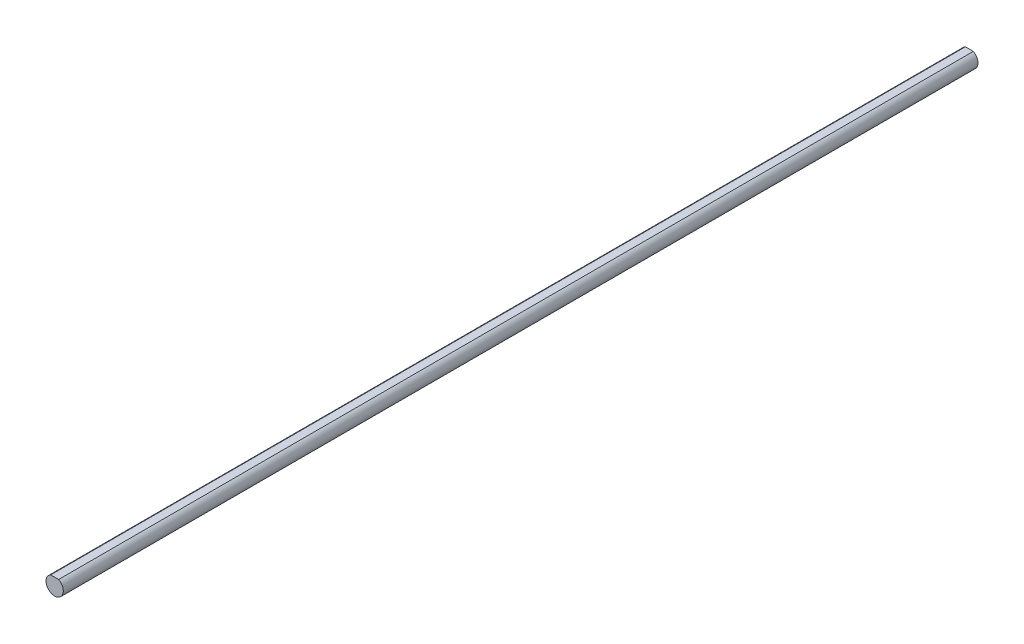
ISO-10303-21;
HEADER;
FILE_DESCRIPTION(('STEP AP214'),'2;1');
FILE_NAME('part.step','',(''),(''),'','','');
FILE_SCHEMA(('AUTOMOTIVE_DESIGN { 1 0 10303 214 1 1 1 1 }'));
ENDSEC;
DATA;
#1=APPLICATION_CONTEXT('core data for automotive mechanical design processes');
#2=APPLICATION_PROTOCOL_DEFINITION('international standard','automotive_design',2000,#1);
#3=PRODUCT_CONTEXT('',#1,'mechanical');
#4=PRODUCT('Part','Part','',(#3));
#5=PRODUCT_RELATED_PRODUCT_CATEGORY('part','',(#4));
#6=PRODUCT_DEFINITION_FORMATION('','',#4);
#7=PRODUCT_DEFINITION_CONTEXT('part definition',#1,'design');
#8=PRODUCT_DEFINITION('design','',#6,#7);
#9=PRODUCT_DEFINITION_SHAPE('','',#8);
#10=(LENGTH_UNIT() NAMED_UNIT(*) SI_UNIT(.MILLI.,.METRE.));
#11=(NAMED_UNIT(*) PLANE_ANGLE_UNIT() SI_UNIT($,.RADIAN.));
#12=(NAMED_UNIT(*) SI_UNIT($,.STERADIAN.) SOLID_ANGLE_UNIT());
#13=UNCERTAINTY_MEASURE_WITH_UNIT(LENGTH_MEASURE(1.E-05),#10,'distance_accuracy_value','');
#14=(GEOMETRIC_REPRESENTATION_CONTEXT(3) GLOBAL_UNCERTAINTY_ASSIGNED_CONTEXT((#13)) GLOBAL_UNIT_ASSIGNED_CONTEXT((#10,
#11,#12)) REPRESENTATION_CONTEXT('',''));
#15=CARTESIAN_POINT('',(0.,0.,0.));
#16=DIRECTION('',(0.,0.,1.));
#17=DIRECTION('',(1.,0.,0.));
#18=AXIS2_PLACEMENT_3D('',#15,#16,#17);
#19=CARTESIAN_POINT('',(0.,0.,-125.));
#20=DIRECTION('',(0.,0.,1.));
#21=DIRECTION('',(1.,0.,0.));
#22=AXIS2_PLACEMENT_3D('',#19,#20,#21);
#23=PLANE('',#22);
#24=DIRECTION('',(1.,0.,0.));
#25=VECTOR('',#24,1.);
#26=CARTESIAN_POINT('',(1.0877614628217,2.1,-125.));
#27=LINE('',#26,#25);
#28=CARTESIAN_POINT('',(1.0877614628217,2.1,-125.));
#29=VERTEX_POINT('',#28);
#30=CARTESIAN_POINT('',(-1.0877614628217,2.1,-125.));
#31=VERTEX_POINT('',#30);
#32=EDGE_CURVE('E43',#29,#31,#27,.F.);
#33=ORIENTED_EDGE('',*,*,#32,.F.);
#34=CARTESIAN_POINT('',(0.,0.,-125.));
#35=DIRECTION('',(0.,0.,1.));
#36=DIRECTION('',(1.,0.,0.));
#37=AXIS2_PLACEMENT_3D('',#34,#35,#36);
#38=CIRCLE('',#37,2.365);
#39=EDGE_CURVE('E20',#31,#29,#38,.T.);
#40=ORIENTED_EDGE('',*,*,#39,.F.);
#41=EDGE_LOOP('',(#33,#40));
#42=FACE_BOUND('',#41,.T.);
#43=ADVANCED_FACE('F17',(#42),#23,.F.);
#44=CARTESIAN_POINT('',(0.,0.,125.));
#45=DIRECTION('',(0.,0.,1.));
#46=DIRECTION('',(1.,0.,0.));
#47=AXIS2_PLACEMENT_3D('',#44,#45,#46);
#48=PLANE('',#47);
#49=CARTESIAN_POINT('',(0.,0.,125.));
#50=DIRECTION('',(0.,0.,1.));
#51=DIRECTION('',(1.,0.,0.));
#52=AXIS2_PLACEMENT_3D('',#49,#50,#51);
#53=CIRCLE('',#52,2.365);
#54=CARTESIAN_POINT('',(1.0877614628217,2.1,125.));
#55=VERTEX_POINT('',#54);
#56=CARTESIAN_POINT('',(-1.0877614628217,2.1,125.));
#57=VERTEX_POINT('',#56);
#58=EDGE_CURVE('E26',#55,#57,#53,.F.);
#59=ORIENTED_EDGE('',*,*,#58,.F.);
#60=DIRECTION('',(1.,0.,0.));
#61=VECTOR('',#60,1.);
#62=CARTESIAN_POINT('',(1.0877614628217,2.1,125.));
#63=LINE('',#62,#61);
#64=EDGE_CURVE('E34',#57,#55,#63,.T.);
#65=ORIENTED_EDGE('',*,*,#64,.F.);
#66=EDGE_LOOP('',(#59,#65));
#67=FACE_BOUND('',#66,.T.);
#68=ADVANCED_FACE('F55',(#67),#48,.T.);
#69=CARTESIAN_POINT('',(1.0877614628217,2.1,-125.));
#70=DIRECTION('',(0.,1.,0.));
#71=DIRECTION('',(0.,0.,1.));
#72=AXIS2_PLACEMENT_3D('',#69,#70,#71);
#73=PLANE('',#72);
#74=ORIENTED_EDGE('',*,*,#64,.T.);
#75=DIRECTION('',(0.,0.,1.));
#76=VECTOR('',#75,1.);
#77=CARTESIAN_POINT('',(1.0877614628217,2.1,-125.));
#78=LINE('',#77,#76);
#79=EDGE_CURVE('E48',#29,#55,#78,.T.);
#80=ORIENTED_EDGE('',*,*,#79,.F.);
#81=ORIENTED_EDGE('',*,*,#32,.T.);
#82=DIRECTION('',(0.,0.,1.));
#83=VECTOR('',#82,1.);
#84=CARTESIAN_POINT('',(-1.0877614628217,2.1,-125.));
#85=LINE('',#84,#83);
#86=EDGE_CURVE('E10',#57,#31,#85,.F.);
#87=ORIENTED_EDGE('',*,*,#86,.F.);
#88=EDGE_LOOP('',(#74,#80,#81,#87));
#89=FACE_BOUND('',#88,.T.);
#90=ADVANCED_FACE('F49',(#89),#73,.T.);
#91=CARTESIAN_POINT('',(0.,0.,-125.));
#92=DIRECTION('',(0.,0.,1.));
#93=DIRECTION('',(1.,0.,0.));
#94=AXIS2_PLACEMENT_3D('',#91,#92,#93);
#95=CYLINDRICAL_SURFACE('',#94,2.365);
#96=ORIENTED_EDGE('',*,*,#58,.T.);
#97=ORIENTED_EDGE('',*,*,#86,.T.);
#98=ORIENTED_EDGE('',*,*,#39,.T.);
#99=ORIENTED_EDGE('',*,*,#79,.T.);
#100=EDGE_LOOP('',(#96,#97,#98,#99));
#101=FACE_BOUND('',#100,.T.);
#102=ADVANCED_FACE('F53',(#101),#95,.T.);
#103=CLOSED_SHELL('',(#43,#68,#90,#102));
#104=MANIFOLD_SOLID_BREP('B1',#103);
#105=ADVANCED_BREP_SHAPE_REPRESENTATION('',(#18,#104),#14);
#106=SHAPE_DEFINITION_REPRESENTATION(#9,#105);
ENDSEC;
END-ISO-10303-21;
